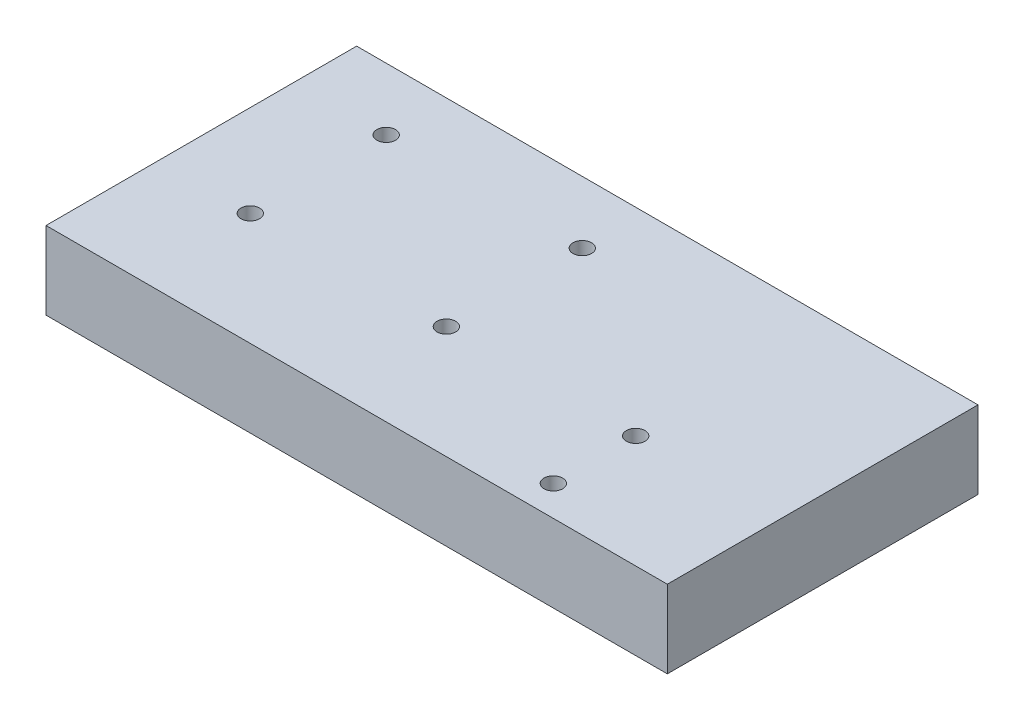
ISO-10303-21;
HEADER;
FILE_DESCRIPTION(('STEP AP214'),'2;1');
FILE_NAME('part.step','',(''),(''),'','','');
FILE_SCHEMA(('AUTOMOTIVE_DESIGN { 1 0 10303 214 1 1 1 1 }'));
ENDSEC;
DATA;
#1=APPLICATION_CONTEXT('core data for automotive mechanical design processes');
#2=APPLICATION_PROTOCOL_DEFINITION('international standard','automotive_design',2000,#1);
#3=PRODUCT_CONTEXT('',#1,'mechanical');
#4=PRODUCT('Part','Part','',(#3));
#5=PRODUCT_RELATED_PRODUCT_CATEGORY('part','',(#4));
#6=PRODUCT_DEFINITION_FORMATION('','',#4);
#7=PRODUCT_DEFINITION_CONTEXT('part definition',#1,'design');
#8=PRODUCT_DEFINITION('design','',#6,#7);
#9=PRODUCT_DEFINITION_SHAPE('','',#8);
#10=(LENGTH_UNIT() NAMED_UNIT(*) SI_UNIT(.MILLI.,.METRE.));
#11=(NAMED_UNIT(*) PLANE_ANGLE_UNIT() SI_UNIT($,.RADIAN.));
#12=(NAMED_UNIT(*) SI_UNIT($,.STERADIAN.) SOLID_ANGLE_UNIT());
#13=UNCERTAINTY_MEASURE_WITH_UNIT(LENGTH_MEASURE(1.E-05),#10,'distance_accuracy_value','');
#14=(GEOMETRIC_REPRESENTATION_CONTEXT(3) GLOBAL_UNCERTAINTY_ASSIGNED_CONTEXT((#13)) GLOBAL_UNIT_ASSIGNED_CONTEXT((#10,
#11,#12)) REPRESENTATION_CONTEXT('',''));
#15=CARTESIAN_POINT('',(0.,0.,0.));
#16=DIRECTION('',(0.,0.,1.));
#17=DIRECTION('',(1.,0.,0.));
#18=AXIS2_PLACEMENT_3D('',#15,#16,#17);
#19=CARTESIAN_POINT('',(0.,-10.,0.));
#20=DIRECTION('',(-1.,0.,0.));
#21=DIRECTION('',(0.,0.,1.));
#22=AXIS2_PLACEMENT_3D('',#19,#20,#21);
#23=PLANE('',#22);
#24=DIRECTION('',(0.,0.,1.));
#25=VECTOR('',#24,1.);
#26=CARTESIAN_POINT('',(0.,0.,0.));
#27=LINE('',#26,#25);
#28=CARTESIAN_POINT('',(0.,0.,-40.));
#29=VERTEX_POINT('',#28);
#30=CARTESIAN_POINT('',(0.,0.,0.));
#31=VERTEX_POINT('',#30);
#32=EDGE_CURVE('E150',#29,#31,#27,.T.);
#33=ORIENTED_EDGE('',*,*,#32,.F.);
#34=DIRECTION('',(0.,1.,0.));
#35=VECTOR('',#34,1.);
#36=CARTESIAN_POINT('',(0.,-10.,-40.));
#37=LINE('',#36,#35);
#38=CARTESIAN_POINT('',(0.,-10.,-40.));
#39=VERTEX_POINT('',#38);
#40=EDGE_CURVE('E11',#39,#29,#37,.T.);
#41=ORIENTED_EDGE('',*,*,#40,.F.);
#42=DIRECTION('',(0.,0.,1.));
#43=VECTOR('',#42,1.);
#44=CARTESIAN_POINT('',(0.,-10.,0.));
#45=LINE('',#44,#43);
#46=CARTESIAN_POINT('',(0.,-10.,0.));
#47=VERTEX_POINT('',#46);
#48=EDGE_CURVE('E151',#39,#47,#45,.T.);
#49=ORIENTED_EDGE('',*,*,#48,.T.);
#50=DIRECTION('',(0.,1.,0.));
#51=VECTOR('',#50,1.);
#52=CARTESIAN_POINT('',(0.,-10.,0.));
#53=LINE('',#52,#51);
#54=EDGE_CURVE('E44',#47,#31,#53,.T.);
#55=ORIENTED_EDGE('',*,*,#54,.T.);
#56=EDGE_LOOP('',(#33,#41,#49,#55));
#57=FACE_BOUND('',#56,.T.);
#58=ADVANCED_FACE('F41',(#57),#23,.T.);
#59=CARTESIAN_POINT('',(0.,-10.,-40.));
#60=DIRECTION('',(0.,0.,-1.));
#61=DIRECTION('',(-1.,0.,0.));
#62=AXIS2_PLACEMENT_3D('',#59,#60,#61);
#63=PLANE('',#62);
#64=DIRECTION('',(-1.,0.,0.));
#65=VECTOR('',#64,1.);
#66=CARTESIAN_POINT('',(0.,0.,-40.));
#67=LINE('',#66,#65);
#68=CARTESIAN_POINT('',(80.,0.,-40.));
#69=VERTEX_POINT('',#68);
#70=EDGE_CURVE('E154',#69,#29,#67,.T.);
#71=ORIENTED_EDGE('',*,*,#70,.F.);
#72=DIRECTION('',(0.,1.,0.));
#73=VECTOR('',#72,1.);
#74=CARTESIAN_POINT('',(80.,-10.,-40.));
#75=LINE('',#74,#73);
#76=CARTESIAN_POINT('',(80.,-10.,-40.));
#77=VERTEX_POINT('',#76);
#78=EDGE_CURVE('E50',#77,#69,#75,.T.);
#79=ORIENTED_EDGE('',*,*,#78,.F.);
#80=DIRECTION('',(-1.,0.,0.));
#81=VECTOR('',#80,1.);
#82=CARTESIAN_POINT('',(0.,-10.,-40.));
#83=LINE('',#82,#81);
#84=EDGE_CURVE('E158',#77,#39,#83,.T.);
#85=ORIENTED_EDGE('',*,*,#84,.T.);
#86=ORIENTED_EDGE('',*,*,#40,.T.);
#87=EDGE_LOOP('',(#71,#79,#85,#86));
#88=FACE_BOUND('',#87,.T.);
#89=ADVANCED_FACE('F173',(#88),#63,.T.);
#90=CARTESIAN_POINT('',(80.,-10.,0.));
#91=DIRECTION('',(1.,0.,0.));
#92=DIRECTION('',(0.,0.,-1.));
#93=AXIS2_PLACEMENT_3D('',#90,#91,#92);
#94=PLANE('',#93);
#95=DIRECTION('',(0.,0.,-1.));
#96=VECTOR('',#95,1.);
#97=CARTESIAN_POINT('',(80.,0.,0.));
#98=LINE('',#97,#96);
#99=CARTESIAN_POINT('',(80.,0.,0.));
#100=VERTEX_POINT('',#99);
#101=EDGE_CURVE('E165',#100,#69,#98,.T.);
#102=ORIENTED_EDGE('',*,*,#101,.F.);
#103=DIRECTION('',(0.,1.,0.));
#104=VECTOR('',#103,1.);
#105=CARTESIAN_POINT('',(80.,-10.,0.));
#106=LINE('',#105,#104);
#107=CARTESIAN_POINT('',(80.,-10.,0.));
#108=VERTEX_POINT('',#107);
#109=EDGE_CURVE('E169',#108,#100,#106,.T.);
#110=ORIENTED_EDGE('',*,*,#109,.F.);
#111=DIRECTION('',(0.,0.,-1.));
#112=VECTOR('',#111,1.);
#113=CARTESIAN_POINT('',(80.,-10.,0.));
#114=LINE('',#113,#112);
#115=EDGE_CURVE('E156',#108,#77,#114,.T.);
#116=ORIENTED_EDGE('',*,*,#115,.T.);
#117=ORIENTED_EDGE('',*,*,#78,.T.);
#118=EDGE_LOOP('',(#102,#110,#116,#117));
#119=FACE_BOUND('',#118,.T.);
#120=ADVANCED_FACE('F176',(#119),#94,.T.);
#121=CARTESIAN_POINT('',(0.,-10.,0.));
#122=DIRECTION('',(0.,0.,1.));
#123=DIRECTION('',(1.,0.,0.));
#124=AXIS2_PLACEMENT_3D('',#121,#122,#123);
#125=PLANE('',#124);
#126=DIRECTION('',(1.,0.,0.));
#127=VECTOR('',#126,1.);
#128=CARTESIAN_POINT('',(0.,0.,0.));
#129=LINE('',#128,#127);
#130=EDGE_CURVE('E162',#31,#100,#129,.T.);
#131=ORIENTED_EDGE('',*,*,#130,.F.);
#132=ORIENTED_EDGE('',*,*,#54,.F.);
#133=DIRECTION('',(1.,0.,0.));
#134=VECTOR('',#133,1.);
#135=CARTESIAN_POINT('',(0.,-10.,0.));
#136=LINE('',#135,#134);
#137=EDGE_CURVE('E153',#47,#108,#136,.T.);
#138=ORIENTED_EDGE('',*,*,#137,.T.);
#139=ORIENTED_EDGE('',*,*,#109,.T.);
#140=EDGE_LOOP('',(#131,#132,#138,#139));
#141=FACE_BOUND('',#140,.T.);
#142=ADVANCED_FACE('F170',(#141),#125,.T.);
#143=CARTESIAN_POINT('',(0.,-10.,0.));
#144=DIRECTION('',(0.,-1.,0.));
#145=DIRECTION('',(0.,0.,-1.));
#146=AXIS2_PLACEMENT_3D('',#143,#144,#145);
#147=PLANE('',#146);
#148=ORIENTED_EDGE('',*,*,#48,.F.);
#149=ORIENTED_EDGE('',*,*,#84,.F.);
#150=ORIENTED_EDGE('',*,*,#115,.F.);
#151=ORIENTED_EDGE('',*,*,#137,.F.);
#152=EDGE_LOOP('',(#148,#149,#150,#151));
#153=FACE_BOUND('',#152,.T.);
#154=ADVANCED_FACE('F178',(#153),#147,.T.);
#155=CARTESIAN_POINT('',(0.,0.,0.));
#156=DIRECTION('',(0.,-1.,0.));
#157=DIRECTION('',(0.,0.,-1.));
#158=AXIS2_PLACEMENT_3D('',#155,#156,#157);
#159=PLANE('',#158);
#160=CARTESIAN_POINT('',(11.8,0.,-32.));
#161=DIRECTION('',(0.,1.,0.));
#162=DIRECTION('',(0.,0.,1.));
#163=AXIS2_PLACEMENT_3D('',#160,#161,#162);
#164=CIRCLE('',#163,1.19999999999999);
#165=CARTESIAN_POINT('',(11.8,0.,-30.8));
#166=VERTEX_POINT('',#165);
#167=EDGE_CURVE('E116',#166,#166,#164,.T.);
#168=ORIENTED_EDGE('',*,*,#167,.F.);
#169=EDGE_LOOP('',(#168));
#170=FACE_BOUND('',#169,.T.);
#171=CARTESIAN_POINT('',(37.05,0.,-32.));
#172=DIRECTION('',(0.,1.,0.));
#173=DIRECTION('',(0.,0.,1.));
#174=AXIS2_PLACEMENT_3D('',#171,#172,#173);
#175=CIRCLE('',#174,1.19999999999999);
#176=CARTESIAN_POINT('',(37.05,0.,-30.8));
#177=VERTEX_POINT('',#176);
#178=EDGE_CURVE('E115',#177,#177,#175,.T.);
#179=ORIENTED_EDGE('',*,*,#178,.F.);
#180=EDGE_LOOP('',(#179));
#181=FACE_BOUND('',#180,.T.);
#182=CARTESIAN_POINT('',(37.05,0.,-14.5));
#183=DIRECTION('',(0.,1.,0.));
#184=DIRECTION('',(0.,0.,1.));
#185=AXIS2_PLACEMENT_3D('',#182,#183,#184);
#186=CIRCLE('',#185,1.19999999999999);
#187=CARTESIAN_POINT('',(37.05,0.,-13.3));
#188=VERTEX_POINT('',#187);
#189=EDGE_CURVE('E126',#188,#188,#186,.T.);
#190=ORIENTED_EDGE('',*,*,#189,.F.);
#191=EDGE_LOOP('',(#190));
#192=FACE_BOUND('',#191,.T.);
#193=CARTESIAN_POINT('',(11.8,0.,-14.5));
#194=DIRECTION('',(0.,1.,0.));
#195=DIRECTION('',(0.,0.,1.));
#196=AXIS2_PLACEMENT_3D('',#193,#194,#195);
#197=CIRCLE('',#196,1.19999999999999);
#198=CARTESIAN_POINT('',(11.8,0.,-13.3));
#199=VERTEX_POINT('',#198);
#200=EDGE_CURVE('E132',#199,#199,#197,.T.);
#201=ORIENTED_EDGE('',*,*,#200,.F.);
#202=EDGE_LOOP('',(#201));
#203=FACE_BOUND('',#202,.T.);
#204=CARTESIAN_POINT('',(61.425,0.,-14.5));
#205=DIRECTION('',(0.,1.,0.));
#206=DIRECTION('',(0.,0.,1.));
#207=AXIS2_PLACEMENT_3D('',#204,#205,#206);
#208=CIRCLE('',#207,1.19999999999999);
#209=CARTESIAN_POINT('',(61.425,0.,-13.3));
#210=VERTEX_POINT('',#209);
#211=EDGE_CURVE('E138',#210,#210,#208,.T.);
#212=ORIENTED_EDGE('',*,*,#211,.F.);
#213=EDGE_LOOP('',(#212));
#214=FACE_BOUND('',#213,.T.);
#215=CARTESIAN_POINT('',(61.425,0.,-3.9));
#216=DIRECTION('',(0.,1.,0.));
#217=DIRECTION('',(0.,0.,1.));
#218=AXIS2_PLACEMENT_3D('',#215,#216,#217);
#219=CIRCLE('',#218,1.19999999999999);
#220=CARTESIAN_POINT('',(61.425,0.,-2.70000000000001));
#221=VERTEX_POINT('',#220);
#222=EDGE_CURVE('E144',#221,#221,#219,.T.);
#223=ORIENTED_EDGE('',*,*,#222,.F.);
#224=EDGE_LOOP('',(#223));
#225=FACE_BOUND('',#224,.T.);
#226=ORIENTED_EDGE('',*,*,#32,.T.);
#227=ORIENTED_EDGE('',*,*,#130,.T.);
#228=ORIENTED_EDGE('',*,*,#101,.T.);
#229=ORIENTED_EDGE('',*,*,#70,.T.);
#230=EDGE_LOOP('',(#226,#227,#228,#229));
#231=FACE_BOUND('',#230,.T.);
#232=ADVANCED_FACE('F172',(#170,#181,#192,#203,#214,#225,#231),#159,.F.);
#233=CARTESIAN_POINT('',(61.425,-6.,-3.9));
#234=DIRECTION('',(0.,1.,0.));
#235=DIRECTION('',(0.,0.,1.));
#236=AXIS2_PLACEMENT_3D('',#233,#234,#235);
#237=CONICAL_SURFACE('',#236,1.19999999999999,1.02974425867665);
#238=CARTESIAN_POINT('',(61.425,-6.72103274283307,-3.9));
#239=VERTEX_POINT('',#238);
#240=VERTEX_LOOP('',#239);
#241=FACE_BOUND('',#240,.T.);
#242=CARTESIAN_POINT('',(61.425,-6.,-3.9));
#243=DIRECTION('',(0.,1.,0.));
#244=DIRECTION('',(0.,0.,1.));
#245=AXIS2_PLACEMENT_3D('',#242,#243,#244);
#246=CIRCLE('',#245,1.19999999999999);
#247=CARTESIAN_POINT('',(61.425,-6.,-2.70000000000001));
#248=VERTEX_POINT('',#247);
#249=EDGE_CURVE('E147',#248,#248,#246,.T.);
#250=ORIENTED_EDGE('',*,*,#249,.T.);
#251=EDGE_LOOP('',(#250));
#252=FACE_BOUND('',#251,.T.);
#253=ADVANCED_FACE('F185',(#241,#252),#237,.F.);
#254=CARTESIAN_POINT('',(61.425,0.,-3.9));
#255=DIRECTION('',(0.,1.,0.));
#256=DIRECTION('',(0.,0.,1.));
#257=AXIS2_PLACEMENT_3D('',#254,#255,#256);
#258=CYLINDRICAL_SURFACE('',#257,1.19999999999999);
#259=ORIENTED_EDGE('',*,*,#249,.F.);
#260=EDGE_LOOP('',(#259));
#261=FACE_BOUND('',#260,.T.);
#262=ORIENTED_EDGE('',*,*,#222,.T.);
#263=EDGE_LOOP('',(#262));
#264=FACE_BOUND('',#263,.T.);
#265=ADVANCED_FACE('F225',(#261,#264),#258,.F.);
#266=CARTESIAN_POINT('',(61.425,-6.,-14.5));
#267=DIRECTION('',(0.,1.,0.));
#268=DIRECTION('',(0.,0.,1.));
#269=AXIS2_PLACEMENT_3D('',#266,#267,#268);
#270=CONICAL_SURFACE('',#269,1.19999999999999,1.02974425867665);
#271=CARTESIAN_POINT('',(61.425,-6.72103274283307,-14.5));
#272=VERTEX_POINT('',#271);
#273=VERTEX_LOOP('',#272);
#274=FACE_BOUND('',#273,.T.);
#275=CARTESIAN_POINT('',(61.425,-6.,-14.5));
#276=DIRECTION('',(0.,1.,0.));
#277=DIRECTION('',(0.,0.,1.));
#278=AXIS2_PLACEMENT_3D('',#275,#276,#277);
#279=CIRCLE('',#278,1.19999999999999);
#280=CARTESIAN_POINT('',(61.425,-6.,-13.3));
#281=VERTEX_POINT('',#280);
#282=EDGE_CURVE('E141',#281,#281,#279,.T.);
#283=ORIENTED_EDGE('',*,*,#282,.T.);
#284=EDGE_LOOP('',(#283));
#285=FACE_BOUND('',#284,.T.);
#286=ADVANCED_FACE('F234',(#274,#285),#270,.F.);
#287=CARTESIAN_POINT('',(61.425,0.,-14.5));
#288=DIRECTION('',(0.,1.,0.));
#289=DIRECTION('',(0.,0.,1.));
#290=AXIS2_PLACEMENT_3D('',#287,#288,#289);
#291=CYLINDRICAL_SURFACE('',#290,1.19999999999999);
#292=ORIENTED_EDGE('',*,*,#282,.F.);
#293=EDGE_LOOP('',(#292));
#294=FACE_BOUND('',#293,.T.);
#295=ORIENTED_EDGE('',*,*,#211,.T.);
#296=EDGE_LOOP('',(#295));
#297=FACE_BOUND('',#296,.T.);
#298=ADVANCED_FACE('F244',(#294,#297),#291,.F.);
#299=CARTESIAN_POINT('',(11.8,-6.,-14.5));
#300=DIRECTION('',(0.,1.,0.));
#301=DIRECTION('',(0.,0.,1.));
#302=AXIS2_PLACEMENT_3D('',#299,#300,#301);
#303=CONICAL_SURFACE('',#302,1.2,1.02974425867665);
#304=CARTESIAN_POINT('',(11.8,-6.72103274283307,-14.5));
#305=VERTEX_POINT('',#304);
#306=VERTEX_LOOP('',#305);
#307=FACE_BOUND('',#306,.T.);
#308=CARTESIAN_POINT('',(11.8,-6.,-14.5));
#309=DIRECTION('',(0.,1.,0.));
#310=DIRECTION('',(0.,0.,1.));
#311=AXIS2_PLACEMENT_3D('',#308,#309,#310);
#312=CIRCLE('',#311,1.2);
#313=CARTESIAN_POINT('',(11.8,-6.,-13.3));
#314=VERTEX_POINT('',#313);
#315=EDGE_CURVE('E135',#314,#314,#312,.T.);
#316=ORIENTED_EDGE('',*,*,#315,.T.);
#317=EDGE_LOOP('',(#316));
#318=FACE_BOUND('',#317,.T.);
#319=ADVANCED_FACE('F254',(#307,#318),#303,.F.);
#320=CARTESIAN_POINT('',(11.8,0.,-14.5));
#321=DIRECTION('',(0.,1.,0.));
#322=DIRECTION('',(0.,0.,1.));
#323=AXIS2_PLACEMENT_3D('',#320,#321,#322);
#324=CYLINDRICAL_SURFACE('',#323,1.19999999999999);
#325=ORIENTED_EDGE('',*,*,#315,.F.);
#326=EDGE_LOOP('',(#325));
#327=FACE_BOUND('',#326,.T.);
#328=ORIENTED_EDGE('',*,*,#200,.T.);
#329=EDGE_LOOP('',(#328));
#330=FACE_BOUND('',#329,.T.);
#331=ADVANCED_FACE('F264',(#327,#330),#324,.F.);
#332=CARTESIAN_POINT('',(37.05,-6.,-14.5));
#333=DIRECTION('',(0.,1.,0.));
#334=DIRECTION('',(0.,0.,1.));
#335=AXIS2_PLACEMENT_3D('',#332,#333,#334);
#336=CONICAL_SURFACE('',#335,1.2,1.02974425867665);
#337=CARTESIAN_POINT('',(37.05,-6.72103274283307,-14.5));
#338=VERTEX_POINT('',#337);
#339=VERTEX_LOOP('',#338);
#340=FACE_BOUND('',#339,.T.);
#341=CARTESIAN_POINT('',(37.05,-6.,-14.5));
#342=DIRECTION('',(0.,1.,0.));
#343=DIRECTION('',(0.,0.,1.));
#344=AXIS2_PLACEMENT_3D('',#341,#342,#343);
#345=CIRCLE('',#344,1.2);
#346=CARTESIAN_POINT('',(37.05,-6.,-13.3));
#347=VERTEX_POINT('',#346);
#348=EDGE_CURVE('E129',#347,#347,#345,.T.);
#349=ORIENTED_EDGE('',*,*,#348,.T.);
#350=EDGE_LOOP('',(#349));
#351=FACE_BOUND('',#350,.T.);
#352=ADVANCED_FACE('F274',(#340,#351),#336,.F.);
#353=CARTESIAN_POINT('',(37.05,0.,-14.5));
#354=DIRECTION('',(0.,1.,0.));
#355=DIRECTION('',(0.,0.,1.));
#356=AXIS2_PLACEMENT_3D('',#353,#354,#355);
#357=CYLINDRICAL_SURFACE('',#356,1.2);
#358=ORIENTED_EDGE('',*,*,#348,.F.);
#359=EDGE_LOOP('',(#358));
#360=FACE_BOUND('',#359,.T.);
#361=ORIENTED_EDGE('',*,*,#189,.T.);
#362=EDGE_LOOP('',(#361));
#363=FACE_BOUND('',#362,.T.);
#364=ADVANCED_FACE('F284',(#360,#363),#357,.F.);
#365=CARTESIAN_POINT('',(37.05,-6.,-32.));
#366=DIRECTION('',(0.,1.,0.));
#367=DIRECTION('',(0.,0.,1.));
#368=AXIS2_PLACEMENT_3D('',#365,#366,#367);
#369=CONICAL_SURFACE('',#368,1.2,1.02974425867665);
#370=CARTESIAN_POINT('',(37.05,-6.72103274283307,-32.));
#371=VERTEX_POINT('',#370);
#372=VERTEX_LOOP('',#371);
#373=FACE_BOUND('',#372,.T.);
#374=CARTESIAN_POINT('',(37.05,-6.,-32.));
#375=DIRECTION('',(0.,1.,0.));
#376=DIRECTION('',(0.,0.,1.));
#377=AXIS2_PLACEMENT_3D('',#374,#375,#376);
#378=CIRCLE('',#377,1.2);
#379=CARTESIAN_POINT('',(37.05,-6.,-30.8));
#380=VERTEX_POINT('',#379);
#381=EDGE_CURVE('E119',#380,#380,#378,.T.);
#382=ORIENTED_EDGE('',*,*,#381,.T.);
#383=EDGE_LOOP('',(#382));
#384=FACE_BOUND('',#383,.T.);
#385=ADVANCED_FACE('F294',(#373,#384),#369,.F.);
#386=CARTESIAN_POINT('',(37.05,0.,-32.));
#387=DIRECTION('',(0.,1.,0.));
#388=DIRECTION('',(0.,0.,1.));
#389=AXIS2_PLACEMENT_3D('',#386,#387,#388);
#390=CYLINDRICAL_SURFACE('',#389,1.19999999999999);
#391=ORIENTED_EDGE('',*,*,#381,.F.);
#392=EDGE_LOOP('',(#391));
#393=FACE_BOUND('',#392,.T.);
#394=ORIENTED_EDGE('',*,*,#178,.T.);
#395=EDGE_LOOP('',(#394));
#396=FACE_BOUND('',#395,.T.);
#397=ADVANCED_FACE('F109',(#393,#396),#390,.F.);
#398=CARTESIAN_POINT('',(11.8,-6.,-32.));
#399=DIRECTION('',(0.,1.,0.));
#400=DIRECTION('',(0.,0.,1.));
#401=AXIS2_PLACEMENT_3D('',#398,#399,#400);
#402=CONICAL_SURFACE('',#401,1.2,1.02974425867665);
#403=CARTESIAN_POINT('',(11.8,-6.72103274283307,-32.));
#404=VERTEX_POINT('',#403);
#405=VERTEX_LOOP('',#404);
#406=FACE_BOUND('',#405,.T.);
#407=CARTESIAN_POINT('',(11.8,-6.,-32.));
#408=DIRECTION('',(0.,1.,0.));
#409=DIRECTION('',(0.,0.,1.));
#410=AXIS2_PLACEMENT_3D('',#407,#408,#409);
#411=CIRCLE('',#410,1.2);
#412=CARTESIAN_POINT('',(11.8,-6.,-30.8));
#413=VERTEX_POINT('',#412);
#414=EDGE_CURVE('E113',#413,#413,#411,.T.);
#415=ORIENTED_EDGE('',*,*,#414,.T.);
#416=EDGE_LOOP('',(#415));
#417=FACE_BOUND('',#416,.T.);
#418=ADVANCED_FACE('F105',(#406,#417),#402,.F.);
#419=CARTESIAN_POINT('',(11.8,0.,-32.));
#420=DIRECTION('',(0.,1.,0.));
#421=DIRECTION('',(0.,0.,1.));
#422=AXIS2_PLACEMENT_3D('',#419,#420,#421);
#423=CYLINDRICAL_SURFACE('',#422,1.19999999999999);
#424=ORIENTED_EDGE('',*,*,#414,.F.);
#425=EDGE_LOOP('',(#424));
#426=FACE_BOUND('',#425,.T.);
#427=ORIENTED_EDGE('',*,*,#167,.T.);
#428=EDGE_LOOP('',(#427));
#429=FACE_BOUND('',#428,.T.);
#430=ADVANCED_FACE('F108',(#426,#429),#423,.F.);
#431=CLOSED_SHELL('',(#58,#89,#120,#142,#154,#232,#253,#265,#286,#298,#319,#331,#352,#364,#385,
#397,#418,#430));
#432=MANIFOLD_SOLID_BREP('B2',#431);
#433=ADVANCED_BREP_SHAPE_REPRESENTATION('',(#18,#432),#14);
#434=SHAPE_DEFINITION_REPRESENTATION(#9,#433);
ENDSEC;
END-ISO-10303-21;
